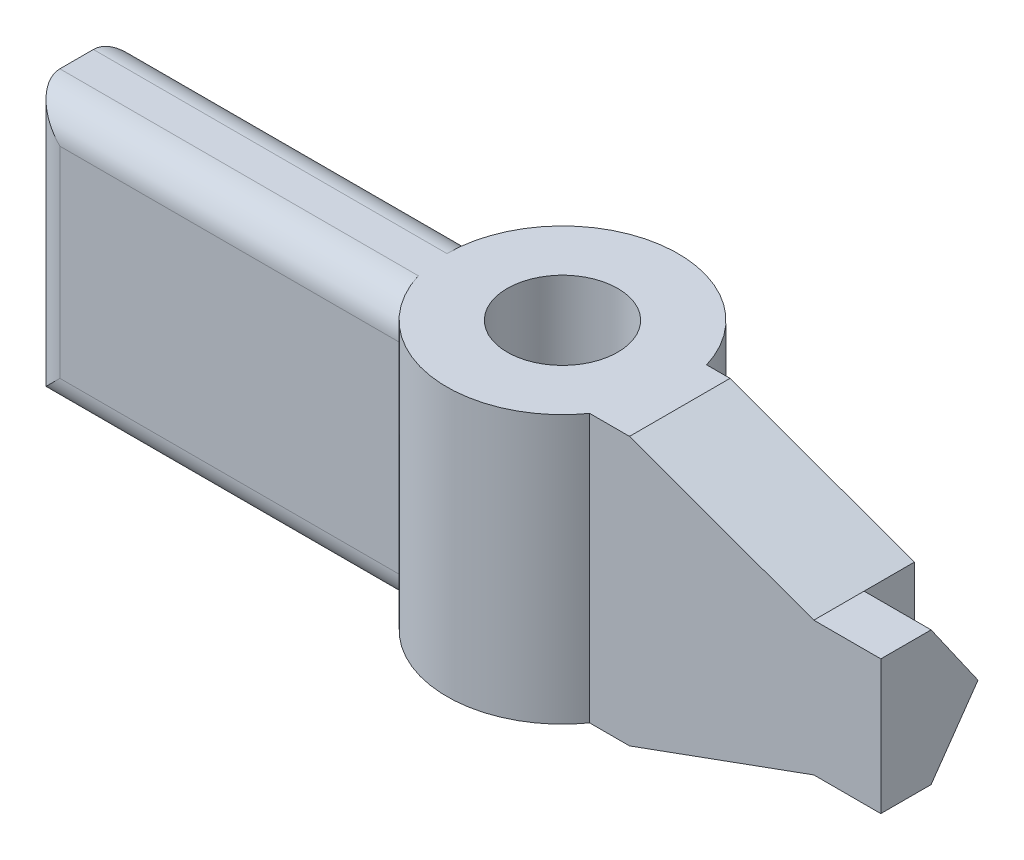
ISO-10303-21;
HEADER;
FILE_DESCRIPTION(('STEP AP214'),'2;1');
FILE_NAME('part.step','',(''),(''),'','','');
FILE_SCHEMA(('AUTOMOTIVE_DESIGN { 1 0 10303 214 1 1 1 1 }'));
ENDSEC;
DATA;
#1=APPLICATION_CONTEXT('core data for automotive mechanical design processes');
#2=APPLICATION_PROTOCOL_DEFINITION('international standard','automotive_design',2000,#1);
#3=PRODUCT_CONTEXT('',#1,'mechanical');
#4=PRODUCT('Part','Part','',(#3));
#5=PRODUCT_RELATED_PRODUCT_CATEGORY('part','',(#4));
#6=PRODUCT_DEFINITION_FORMATION('','',#4);
#7=PRODUCT_DEFINITION_CONTEXT('part definition',#1,'design');
#8=PRODUCT_DEFINITION('design','',#6,#7);
#9=PRODUCT_DEFINITION_SHAPE('','',#8);
#10=(LENGTH_UNIT() NAMED_UNIT(*) SI_UNIT(.MILLI.,.METRE.));
#11=(NAMED_UNIT(*) PLANE_ANGLE_UNIT() SI_UNIT($,.RADIAN.));
#12=(NAMED_UNIT(*) SI_UNIT($,.STERADIAN.) SOLID_ANGLE_UNIT());
#13=UNCERTAINTY_MEASURE_WITH_UNIT(LENGTH_MEASURE(1.E-05),#10,'distance_accuracy_value','');
#14=(GEOMETRIC_REPRESENTATION_CONTEXT(3) GLOBAL_UNCERTAINTY_ASSIGNED_CONTEXT((#13)) GLOBAL_UNIT_ASSIGNED_CONTEXT((#10,
#11,#12)) REPRESENTATION_CONTEXT('',''));
#15=CARTESIAN_POINT('',(0.,0.,0.));
#16=DIRECTION('',(0.,0.,1.));
#17=DIRECTION('',(1.,0.,0.));
#18=AXIS2_PLACEMENT_3D('',#15,#16,#17);
#19=CARTESIAN_POINT('',(4.55189337472552,-29.6222556002751,2.5));
#20=DIRECTION('',(0.,0.,1.));
#21=DIRECTION('',(1.,0.,0.));
#22=AXIS2_PLACEMENT_3D('',#19,#20,#21);
#23=PLANE('',#22);
#24=DIRECTION('',(0.,1.,0.));
#25=VECTOR('',#24,1.);
#26=CARTESIAN_POINT('',(10.7500000214943,-2.,2.5));
#27=LINE('',#26,#25);
#28=CARTESIAN_POINT('',(10.7500000214943,-1.99999921370737,2.5));
#29=VERTEX_POINT('',#28);
#30=CARTESIAN_POINT('',(10.7500000214943,2.,2.5));
#31=VERTEX_POINT('',#30);
#32=EDGE_CURVE('E163',#29,#31,#27,.T.);
#33=ORIENTED_EDGE('',*,*,#32,.F.);
#34=DIRECTION('',(0.939793402771048,0.341743120059518,0.));
#35=VECTOR('',#34,1.);
#36=CARTESIAN_POINT('',(5.2499999785057,-3.99999960685369,2.5));
#37=LINE('',#36,#35);
#38=CARTESIAN_POINT('',(5.2499999785057,-3.99999960685369,2.5));
#39=VERTEX_POINT('',#38);
#40=EDGE_CURVE('E193',#39,#29,#37,.T.);
#41=ORIENTED_EDGE('',*,*,#40,.F.);
#42=DIRECTION('',(-1.,0.,0.));
#43=VECTOR('',#42,1.);
#44=CARTESIAN_POINT('',(4.55189337472551,-3.99999960685369,2.5));
#45=LINE('',#44,#43);
#46=CARTESIAN_POINT('',(4.55189337472552,-3.99999960685369,2.5));
#47=VERTEX_POINT('',#46);
#48=EDGE_CURVE('E194',#39,#47,#45,.T.);
#49=ORIENTED_EDGE('',*,*,#48,.T.);
#50=DIRECTION('',(0.,1.,0.));
#51=VECTOR('',#50,1.);
#52=CARTESIAN_POINT('',(4.55189337472552,-29.6222556002751,2.5));
#53=LINE('',#52,#51);
#54=CARTESIAN_POINT('',(4.55189337472552,4.00000039314631,2.5));
#55=VERTEX_POINT('',#54);
#56=EDGE_CURVE('E503',#47,#55,#53,.T.);
#57=ORIENTED_EDGE('',*,*,#56,.T.);
#58=DIRECTION('',(1.,0.,0.));
#59=VECTOR('',#58,1.);
#60=CARTESIAN_POINT('',(4.55189337472552,4.00000039314631,2.5));
#61=LINE('',#60,#59);
#62=CARTESIAN_POINT('',(5.2499999785057,4.00000039314631,2.5));
#63=VERTEX_POINT('',#62);
#64=EDGE_CURVE('E192',#55,#63,#61,.T.);
#65=ORIENTED_EDGE('',*,*,#64,.T.);
#66=DIRECTION('',(-0.939793402771049,0.341743120059517,0.));
#67=VECTOR('',#66,1.);
#68=CARTESIAN_POINT('',(5.2499999785057,4.00000039314631,2.5));
#69=LINE('',#68,#67);
#70=EDGE_CURVE('E183',#31,#63,#69,.T.);
#71=ORIENTED_EDGE('',*,*,#70,.F.);
#72=EDGE_LOOP('',(#33,#41,#49,#57,#65,#71));
#73=FACE_BOUND('',#72,.T.);
#74=ADVANCED_FACE('F33',(#73),#23,.F.);
#75=CARTESIAN_POINT('',(-12.7500000214943,-3.99999960685369,7.));
#76=DIRECTION('',(1.,0.,0.));
#77=DIRECTION('',(0.,0.,-1.));
#78=AXIS2_PLACEMENT_3D('',#75,#76,#77);
#79=PLANE('',#78);
#80=DIRECTION('',(0.,0.,-1.));
#81=VECTOR('',#80,1.);
#82=CARTESIAN_POINT('',(-12.7500000214943,-3.99999960685369,7.));
#83=LINE('',#82,#81);
#84=CARTESIAN_POINT('',(-12.7500000214943,-3.99999960685369,4.5));
#85=VERTEX_POINT('',#84);
#86=CARTESIAN_POINT('',(-12.7500000214943,-3.99999960685369,3.5));
#87=VERTEX_POINT('',#86);
#88=EDGE_CURVE('E215',#85,#87,#83,.T.);
#89=ORIENTED_EDGE('',*,*,#88,.F.);
#90=DIRECTION('',(0.,1.,0.));
#91=VECTOR('',#90,1.);
#92=CARTESIAN_POINT('',(-12.7500000214943,-3.99999960685369,4.5));
#93=LINE('',#92,#91);
#94=CARTESIAN_POINT('',(-12.7500000214943,4.00000039314631,4.5));
#95=VERTEX_POINT('',#94);
#96=EDGE_CURVE('E235',#85,#95,#93,.T.);
#97=ORIENTED_EDGE('',*,*,#96,.T.);
#98=DIRECTION('',(0.,0.,-1.));
#99=VECTOR('',#98,1.);
#100=CARTESIAN_POINT('',(-12.7500000214943,4.00000039314631,7.));
#101=LINE('',#100,#99);
#102=CARTESIAN_POINT('',(-12.7500000214943,4.00000039314631,3.5));
#103=VERTEX_POINT('',#102);
#104=EDGE_CURVE('E218',#95,#103,#101,.T.);
#105=ORIENTED_EDGE('',*,*,#104,.T.);
#106=DIRECTION('',(0.,1.,0.));
#107=VECTOR('',#106,1.);
#108=CARTESIAN_POINT('',(-12.7500000214943,-3.99999960685369,3.5));
#109=LINE('',#108,#107);
#110=EDGE_CURVE('E233',#103,#87,#109,.F.);
#111=ORIENTED_EDGE('',*,*,#110,.T.);
#112=EDGE_LOOP('',(#89,#97,#105,#111));
#113=FACE_BOUND('',#112,.T.);
#114=ADVANCED_FACE('F271',(#113),#79,.F.);
#115=CARTESIAN_POINT('',(5.2499999785057,-3.99999960685369,7.));
#116=DIRECTION('',(0.,1.,0.));
#117=DIRECTION('',(-1.,0.,0.));
#118=AXIS2_PLACEMENT_3D('',#115,#116,#117);
#119=PLANE('',#118);
#120=CARTESIAN_POINT('',(1.24999997850571,-3.99999960685369,3.5));
#121=DIRECTION('',(0.,1.,0.));
#122=DIRECTION('',(-1.,0.,0.));
#123=AXIS2_PLACEMENT_3D('',#120,#121,#122);
#124=CIRCLE('',#123,1.65);
#125=CARTESIAN_POINT('',(-0.400000021494294,-3.99999960685369,3.5));
#126=VERTEX_POINT('',#125);
#127=EDGE_CURVE('E468',#126,#126,#124,.F.);
#128=ORIENTED_EDGE('',*,*,#127,.F.);
#129=EDGE_LOOP('',(#128));
#130=FACE_BOUND('',#129,.T.);
#131=CARTESIAN_POINT('',(1.24999997850571,-3.99999960685369,3.5));
#132=DIRECTION('',(0.,1.,0.));
#133=DIRECTION('',(-1.,0.,0.));
#134=AXIS2_PLACEMENT_3D('',#131,#132,#133);
#135=CIRCLE('',#134,3.45);
#136=CARTESIAN_POINT('',(-2.0518934177141,-3.99999960685369,4.5));
#137=VERTEX_POINT('',#136);
#138=CARTESIAN_POINT('',(4.06113853787983,-3.99999960685369,5.50000000000001));
#139=VERTEX_POINT('',#138);
#140=EDGE_CURVE('E474',#137,#139,#135,.T.);
#141=ORIENTED_EDGE('',*,*,#140,.F.);
#142=DIRECTION('',(1.,0.,0.));
#143=VECTOR('',#142,1.);
#144=CARTESIAN_POINT('',(5.2499999785057,-3.99999960685369,4.5));
#145=LINE('',#144,#143);
#146=EDGE_CURVE('E240',#137,#85,#145,.F.);
#147=ORIENTED_EDGE('',*,*,#146,.T.);
#148=ORIENTED_EDGE('',*,*,#88,.T.);
#149=DIRECTION('',(-1.,0.,0.));
#150=VECTOR('',#149,1.);
#151=CARTESIAN_POINT('',(5.2499999785057,-3.99999960685369,3.5));
#152=LINE('',#151,#150);
#153=CARTESIAN_POINT('',(-2.20000002149429,-3.99999960685369,3.5));
#154=VERTEX_POINT('',#153);
#155=EDGE_CURVE('E237',#87,#154,#152,.F.);
#156=ORIENTED_EDGE('',*,*,#155,.T.);
#157=CARTESIAN_POINT('',(1.24999997850571,-3.99999960685369,3.5));
#158=DIRECTION('',(0.,1.,0.));
#159=DIRECTION('',(-1.,0.,0.));
#160=AXIS2_PLACEMENT_3D('',#157,#158,#159);
#161=CIRCLE('',#160,3.45);
#162=EDGE_CURVE('E198',#47,#154,#161,.T.);
#163=ORIENTED_EDGE('',*,*,#162,.F.);
#164=ORIENTED_EDGE('',*,*,#48,.F.);
#165=DIRECTION('',(0.,0.,-1.));
#166=VECTOR('',#165,1.);
#167=CARTESIAN_POINT('',(5.2499999785057,-3.99999960685369,7.));
#168=LINE('',#167,#166);
#169=CARTESIAN_POINT('',(5.2499999785057,-3.99999960685369,5.50000000000001));
#170=VERTEX_POINT('',#169);
#171=EDGE_CURVE('E213',#170,#39,#168,.T.);
#172=ORIENTED_EDGE('',*,*,#171,.F.);
#173=DIRECTION('',(1.,0.,0.));
#174=VECTOR('',#173,1.);
#175=CARTESIAN_POINT('',(4.06113853787982,-3.99999960685369,5.50000000000001));
#176=LINE('',#175,#174);
#177=EDGE_CURVE('E472',#139,#170,#176,.T.);
#178=ORIENTED_EDGE('',*,*,#177,.F.);
#179=EDGE_LOOP('',(#141,#147,#148,#156,#163,#164,#172,#178));
#180=FACE_BOUND('',#179,.T.);
#181=ADVANCED_FACE('F320',(#130,#180),#119,.F.);
#182=CARTESIAN_POINT('',(5.2499999785057,-3.99999960685369,7.));
#183=DIRECTION('',(-0.341743120059518,0.939793402771048,0.));
#184=DIRECTION('',(-0.939793402771048,-0.341743120059518,0.));
#185=AXIS2_PLACEMENT_3D('',#182,#183,#184);
#186=PLANE('',#185);
#187=DIRECTION('',(0.,0.,-1.));
#188=VECTOR('',#187,1.);
#189=CARTESIAN_POINT('',(10.7500000214943,-1.99999921370737,7.));
#190=LINE('',#189,#188);
#191=CARTESIAN_POINT('',(10.7500000214943,-1.99999921370737,5.50000000000001));
#192=VERTEX_POINT('',#191);
#193=CARTESIAN_POINT('',(10.7500000214943,-2.,4.));
#194=VERTEX_POINT('',#193);
#195=EDGE_CURVE('E210',#192,#194,#190,.T.);
#196=ORIENTED_EDGE('',*,*,#195,.F.);
#197=DIRECTION('',(-0.939793402771048,-0.341743120059518,0.));
#198=VECTOR('',#197,1.);
#199=CARTESIAN_POINT('',(5.2499999785057,-3.99999960685369,5.50000000000001));
#200=LINE('',#199,#198);
#201=EDGE_CURVE('E495',#192,#170,#200,.T.);
#202=ORIENTED_EDGE('',*,*,#201,.T.);
#203=ORIENTED_EDGE('',*,*,#171,.T.);
#204=ORIENTED_EDGE('',*,*,#40,.T.);
#205=DIRECTION('',(0.,0.,-1.));
#206=VECTOR('',#205,1.);
#207=CARTESIAN_POINT('',(10.7500000214943,-2.,4.));
#208=LINE('',#207,#206);
#209=EDGE_CURVE('E171',#194,#29,#208,.T.);
#210=ORIENTED_EDGE('',*,*,#209,.F.);
#211=EDGE_LOOP('',(#196,#202,#203,#204,#210));
#212=FACE_BOUND('',#211,.T.);
#213=ADVANCED_FACE('F317',(#212),#186,.F.);
#214=CARTESIAN_POINT('',(12.7500000214943,-1.99999921370737,7.));
#215=DIRECTION('',(0.,1.,0.));
#216=DIRECTION('',(-1.,0.,0.));
#217=AXIS2_PLACEMENT_3D('',#214,#215,#216);
#218=PLANE('',#217);
#219=ORIENTED_EDGE('',*,*,#195,.T.);
#220=DIRECTION('',(1.,0.,0.));
#221=VECTOR('',#220,1.);
#222=CARTESIAN_POINT('',(10.7500000214943,-2.,4.));
#223=LINE('',#222,#221);
#224=CARTESIAN_POINT('',(12.7500000214943,-2.,4.));
#225=VERTEX_POINT('',#224);
#226=EDGE_CURVE('E458',#194,#225,#223,.T.);
#227=ORIENTED_EDGE('',*,*,#226,.T.);
#228=DIRECTION('',(0.,0.,-1.));
#229=VECTOR('',#228,1.);
#230=CARTESIAN_POINT('',(12.7500000214943,-1.99999921370737,7.));
#231=LINE('',#230,#229);
#232=CARTESIAN_POINT('',(12.7500000214943,-1.99999921370737,5.50000000000001));
#233=VERTEX_POINT('',#232);
#234=EDGE_CURVE('E207',#233,#225,#231,.T.);
#235=ORIENTED_EDGE('',*,*,#234,.F.);
#236=DIRECTION('',(-1.,0.,0.));
#237=VECTOR('',#236,1.);
#238=CARTESIAN_POINT('',(12.7500000214943,-1.99999921370737,5.50000000000001));
#239=LINE('',#238,#237);
#240=EDGE_CURVE('E492',#233,#192,#239,.T.);
#241=ORIENTED_EDGE('',*,*,#240,.T.);
#242=EDGE_LOOP('',(#219,#227,#235,#241));
#243=FACE_BOUND('',#242,.T.);
#244=ADVANCED_FACE('F313',(#243),#218,.F.);
#245=CARTESIAN_POINT('',(12.7500000214943,2.,7.));
#246=DIRECTION('',(-1.,0.,0.));
#247=DIRECTION('',(0.,0.,1.));
#248=AXIS2_PLACEMENT_3D('',#245,#246,#247);
#249=PLANE('',#248);
#250=ORIENTED_EDGE('',*,*,#234,.T.);
#251=DIRECTION('',(0.,-0.81923192051904,0.573462344363329));
#252=VECTOR('',#251,1.);
#253=CARTESIAN_POINT('',(12.7500000214943,-2.,4.));
#254=LINE('',#253,#252);
#255=CARTESIAN_POINT('',(12.7500000214943,0.,2.6));
#256=VERTEX_POINT('',#255);
#257=EDGE_CURVE('E176',#256,#225,#254,.T.);
#258=ORIENTED_EDGE('',*,*,#257,.F.);
#259=DIRECTION('',(0.,-0.81923192051904,-0.573462344363329));
#260=VECTOR('',#259,1.);
#261=CARTESIAN_POINT('',(12.7500000214943,2.,4.));
#262=LINE('',#261,#260);
#263=CARTESIAN_POINT('',(12.7500000214943,2.,4.));
#264=VERTEX_POINT('',#263);
#265=EDGE_CURVE('E445',#264,#256,#262,.T.);
#266=ORIENTED_EDGE('',*,*,#265,.F.);
#267=DIRECTION('',(0.,0.,-1.));
#268=VECTOR('',#267,1.);
#269=CARTESIAN_POINT('',(12.7500000214943,2.,7.));
#270=LINE('',#269,#268);
#271=CARTESIAN_POINT('',(12.7500000214943,2.,5.50000000000001));
#272=VERTEX_POINT('',#271);
#273=EDGE_CURVE('E204',#272,#264,#270,.T.);
#274=ORIENTED_EDGE('',*,*,#273,.F.);
#275=DIRECTION('',(0.,1.,0.));
#276=VECTOR('',#275,1.);
#277=CARTESIAN_POINT('',(12.7500000214943,-29.6222556002751,5.50000000000001));
#278=LINE('',#277,#276);
#279=EDGE_CURVE('E484',#233,#272,#278,.T.);
#280=ORIENTED_EDGE('',*,*,#279,.F.);
#281=EDGE_LOOP('',(#250,#258,#266,#274,#280));
#282=FACE_BOUND('',#281,.T.);
#283=ADVANCED_FACE('F309',(#282),#249,.F.);
#284=CARTESIAN_POINT('',(10.7500000214943,2.,7.));
#285=DIRECTION('',(0.,-1.,0.));
#286=DIRECTION('',(0.,0.,-1.));
#287=AXIS2_PLACEMENT_3D('',#284,#285,#286);
#288=PLANE('',#287);
#289=ORIENTED_EDGE('',*,*,#273,.T.);
#290=DIRECTION('',(1.,0.,0.));
#291=VECTOR('',#290,1.);
#292=CARTESIAN_POINT('',(10.7500000214943,2.,4.));
#293=LINE('',#292,#291);
#294=CARTESIAN_POINT('',(10.7500000214943,2.,4.));
#295=VERTEX_POINT('',#294);
#296=EDGE_CURVE('E464',#295,#264,#293,.T.);
#297=ORIENTED_EDGE('',*,*,#296,.F.);
#298=DIRECTION('',(0.,0.,-1.));
#299=VECTOR('',#298,1.);
#300=CARTESIAN_POINT('',(10.7500000214943,2.,7.));
#301=LINE('',#300,#299);
#302=CARTESIAN_POINT('',(10.7500000214943,2.,5.50000000000001));
#303=VERTEX_POINT('',#302);
#304=EDGE_CURVE('E186',#303,#295,#301,.T.);
#305=ORIENTED_EDGE('',*,*,#304,.F.);
#306=DIRECTION('',(1.,0.,0.));
#307=VECTOR('',#306,1.);
#308=CARTESIAN_POINT('',(10.7500000214943,2.,5.50000000000001));
#309=LINE('',#308,#307);
#310=EDGE_CURVE('E489',#303,#272,#309,.T.);
#311=ORIENTED_EDGE('',*,*,#310,.T.);
#312=EDGE_LOOP('',(#289,#297,#305,#311));
#313=FACE_BOUND('',#312,.T.);
#314=ADVANCED_FACE('F306',(#313),#288,.F.);
#315=CARTESIAN_POINT('',(5.2499999785057,4.00000039314631,7.));
#316=DIRECTION('',(-0.341743120059517,-0.939793402771049,0.));
#317=DIRECTION('',(0.939793402771049,-0.341743120059517,0.));
#318=AXIS2_PLACEMENT_3D('',#315,#316,#317);
#319=PLANE('',#318);
#320=DIRECTION('',(0.,0.,-1.));
#321=VECTOR('',#320,1.);
#322=CARTESIAN_POINT('',(5.2499999785057,4.00000039314631,7.));
#323=LINE('',#322,#321);
#324=CARTESIAN_POINT('',(5.2499999785057,4.00000039314631,5.50000000000001));
#325=VERTEX_POINT('',#324);
#326=EDGE_CURVE('E196',#325,#63,#323,.T.);
#327=ORIENTED_EDGE('',*,*,#326,.F.);
#328=DIRECTION('',(0.939793402771049,-0.341743120059517,0.));
#329=VECTOR('',#328,1.);
#330=CARTESIAN_POINT('',(5.2499999785057,4.00000039314631,5.50000000000001));
#331=LINE('',#330,#329);
#332=EDGE_CURVE('E477',#325,#303,#331,.T.);
#333=ORIENTED_EDGE('',*,*,#332,.T.);
#334=ORIENTED_EDGE('',*,*,#304,.T.);
#335=DIRECTION('',(0.,0.,1.));
#336=VECTOR('',#335,1.);
#337=CARTESIAN_POINT('',(10.7500000214943,2.,2.5));
#338=LINE('',#337,#336);
#339=EDGE_CURVE('E167',#31,#295,#338,.T.);
#340=ORIENTED_EDGE('',*,*,#339,.F.);
#341=ORIENTED_EDGE('',*,*,#70,.T.);
#342=EDGE_LOOP('',(#327,#333,#334,#340,#341));
#343=FACE_BOUND('',#342,.T.);
#344=ADVANCED_FACE('F182',(#343),#319,.F.);
#345=CARTESIAN_POINT('',(-2.7500000214943,4.00000039314631,7.));
#346=DIRECTION('',(0.,-1.,0.));
#347=DIRECTION('',(0.,0.,-1.));
#348=AXIS2_PLACEMENT_3D('',#345,#346,#347);
#349=PLANE('',#348);
#350=CARTESIAN_POINT('',(1.24999997850571,4.00000039314631,3.5));
#351=DIRECTION('',(0.,1.,0.));
#352=DIRECTION('',(0.,0.,-1.));
#353=AXIS2_PLACEMENT_3D('',#350,#351,#352);
#354=CIRCLE('',#353,1.65);
#355=CARTESIAN_POINT('',(1.24999997850571,4.00000039314631,1.85));
#356=VERTEX_POINT('',#355);
#357=EDGE_CURVE('E461',#356,#356,#354,.T.);
#358=ORIENTED_EDGE('',*,*,#357,.F.);
#359=EDGE_LOOP('',(#358));
#360=FACE_BOUND('',#359,.T.);
#361=ORIENTED_EDGE('',*,*,#104,.F.);
#362=DIRECTION('',(-1.,0.,0.));
#363=VECTOR('',#362,1.);
#364=CARTESIAN_POINT('',(-2.7500000214943,4.00000039314631,4.5));
#365=LINE('',#364,#363);
#366=CARTESIAN_POINT('',(-2.0518934177141,4.00000039314631,4.5));
#367=VERTEX_POINT('',#366);
#368=EDGE_CURVE('E230',#95,#367,#365,.F.);
#369=ORIENTED_EDGE('',*,*,#368,.T.);
#370=CARTESIAN_POINT('',(1.24999997850571,4.00000039314631,3.5));
#371=DIRECTION('',(0.,-1.,0.));
#372=DIRECTION('',(0.,0.,1.));
#373=AXIS2_PLACEMENT_3D('',#370,#371,#372);
#374=CIRCLE('',#373,3.45);
#375=CARTESIAN_POINT('',(4.06113853787983,4.00000039314631,5.50000000000001));
#376=VERTEX_POINT('',#375);
#377=EDGE_CURVE('E471',#376,#367,#374,.T.);
#378=ORIENTED_EDGE('',*,*,#377,.F.);
#379=DIRECTION('',(-1.,0.,0.));
#380=VECTOR('',#379,1.);
#381=CARTESIAN_POINT('',(4.06113853787983,4.00000039314631,5.50000000000001));
#382=LINE('',#381,#380);
#383=EDGE_CURVE('E479',#325,#376,#382,.T.);
#384=ORIENTED_EDGE('',*,*,#383,.F.);
#385=ORIENTED_EDGE('',*,*,#326,.T.);
#386=ORIENTED_EDGE('',*,*,#64,.F.);
#387=CARTESIAN_POINT('',(1.24999997850571,4.00000039314631,3.5));
#388=DIRECTION('',(0.,-1.,0.));
#389=DIRECTION('',(0.,0.,1.));
#390=AXIS2_PLACEMENT_3D('',#387,#388,#389);
#391=CIRCLE('',#390,3.45);
#392=CARTESIAN_POINT('',(-2.20000002149429,4.00000039314631,3.5));
#393=VERTEX_POINT('',#392);
#394=EDGE_CURVE('E498',#393,#55,#391,.T.);
#395=ORIENTED_EDGE('',*,*,#394,.F.);
#396=DIRECTION('',(1.,0.,0.));
#397=VECTOR('',#396,1.);
#398=CARTESIAN_POINT('',(-2.7500000214943,4.00000039314631,3.5));
#399=LINE('',#398,#397);
#400=EDGE_CURVE('E228',#393,#103,#399,.F.);
#401=ORIENTED_EDGE('',*,*,#400,.T.);
#402=EDGE_LOOP('',(#361,#369,#378,#384,#385,#386,#395,#401));
#403=FACE_BOUND('',#402,.T.);
#404=ADVANCED_FACE('F298',(#360,#403),#349,.F.);
#405=CARTESIAN_POINT('',(1.24999997850571,-29.6222556002751,3.5));
#406=DIRECTION('',(0.,1.,0.));
#407=DIRECTION('',(0.,0.,1.));
#408=AXIS2_PLACEMENT_3D('',#405,#406,#407);
#409=CYLINDRICAL_SURFACE('',#408,3.45);
#410=ORIENTED_EDGE('',*,*,#162,.T.);
#411=CARTESIAN_POINT('',(-2.20000002149429,-3.99999960685369,3.5));
#412=CARTESIAN_POINT('',(-2.2000018186365,-4.00000005976207,3.47247568580753));
#413=CARTESIAN_POINT('',(-2.19967023770615,-3.99886249286738,3.4449650885411));
#414=CARTESIAN_POINT('',(-2.19835948173658,-3.99432848692219,3.39015136632369));
#415=CARTESIAN_POINT('',(-2.19738042933208,-3.99093247563304,3.3628482030739));
#416=CARTESIAN_POINT('',(-2.19350893526232,-3.97741096564679,3.28167883124371));
#417=CARTESIAN_POINT('',(-2.18968190929803,-3.96395172890271,3.22837320570246));
#418=CARTESIAN_POINT('',(-2.17994221924015,-3.92859473069727,3.12489275289327));
#419=CARTESIAN_POINT('',(-2.17402991860865,-3.90669843974779,3.0747173818164));
#420=CARTESIAN_POINT('',(-2.16073677324155,-3.85512798710265,2.97872840882544));
#421=CARTESIAN_POINT('',(-2.1533553584972,-3.8254508050385,2.93291651014914));
#422=CARTESIAN_POINT('',(-2.13769423876483,-3.75832697391133,2.84575339156167));
#423=CARTESIAN_POINT('',(-2.12939717162977,-3.72071031105168,2.8045362887991));
#424=CARTESIAN_POINT('',(-2.11294458914971,-3.63913147877234,2.72889350549633));
#425=CARTESIAN_POINT('',(-2.10478910982013,-3.59516772059835,2.69446953047924));
#426=CARTESIAN_POINT('',(-2.08935888528671,-3.50101469073373,2.63269342444564));
#427=CARTESIAN_POINT('',(-2.08210632152021,-3.45071375143932,2.60550560588157));
#428=CARTESIAN_POINT('',(-2.06956993268079,-3.34602659672756,2.56004527390904));
#429=CARTESIAN_POINT('',(-2.06428431604705,-3.29164415341256,2.54176464281931));
#430=CARTESIAN_POINT('',(-2.05757091852246,-3.19749274026799,2.51889249057409));
#431=CARTESIAN_POINT('',(-2.05545712311073,-3.15835751731527,2.51182205581527));
#432=CARTESIAN_POINT('',(-2.05261158528801,-3.07948927821282,2.50237117494375));
#433=CARTESIAN_POINT('',(-2.05187939868124,-3.03975645833672,2.49998922144464));
#434=CARTESIAN_POINT('',(-2.0518934177141,-2.99999960685369,2.5));
#435=B_SPLINE_CURVE_WITH_KNOTS('',3,(#411,#412,#413,#414,#415,#416,#417,#418,#419,#420,#421,
#422,#423,#424,#425,#426,#427,#428,#429,#430,#431,#432,#433,#434),.UNSPECIFIED.,.F.,.F.,(4,2,2,
2,2,2,2,2,2,2,2,4),(0.,0.0825205058444888,0.165025386317305,0.329503611712889,0.493953182810833,
0.658466684322334,0.826945128512405,0.995465818237975,1.16753775995018,1.33945258696452,
1.4586391129712,1.57778731323737),.UNSPECIFIED.);
#436=CARTESIAN_POINT('',(-2.0518934177141,-2.99999960685369,2.5));
#437=VERTEX_POINT('',#436);
#438=EDGE_CURVE('E43',#154,#437,#435,.T.);
#439=ORIENTED_EDGE('',*,*,#438,.T.);
#440=DIRECTION('',(0.,1.,0.));
#441=VECTOR('',#440,1.);
#442=CARTESIAN_POINT('',(-2.0518934177141,-29.6222556002751,2.5));
#443=LINE('',#442,#441);
#444=CARTESIAN_POINT('',(-2.0518934177141,3.00000039314631,2.5));
#445=VERTEX_POINT('',#444);
#446=EDGE_CURVE('E500',#437,#445,#443,.T.);
#447=ORIENTED_EDGE('',*,*,#446,.T.);
#448=CARTESIAN_POINT('',(-2.0518934177141,3.00000039314631,2.5));
#449=CARTESIAN_POINT('',(-2.05189117613897,3.02750011168371,2.49999948141562));
#450=CARTESIAN_POINT('',(-2.05223739957496,3.05498602947934,2.50113507810029));
#451=CARTESIAN_POINT('',(-2.05360379854214,3.10974898039133,2.50566080906622));
#452=CARTESIAN_POINT('',(-2.05462383090197,3.13702605663723,2.50905046440464));
#453=CARTESIAN_POINT('',(-2.05865138121763,3.218107875543,2.52254444568107));
#454=CARTESIAN_POINT('',(-2.0626266594985,3.27135018661563,2.53597406810182));
#455=CARTESIAN_POINT('',(-2.07268650220836,3.37470027111696,2.57124495691434));
#456=CARTESIAN_POINT('',(-2.07877048435104,3.42480890535831,2.59308390138502));
#457=CARTESIAN_POINT('',(-2.09235843768682,3.52068673692262,2.64452015072984));
#458=CARTESIAN_POINT('',(-2.09986305497996,3.56645394550765,2.67412098805518));
#459=CARTESIAN_POINT('',(-2.11569228680892,3.65366340237284,2.74116525721702));
#460=CARTESIAN_POINT('',(-2.1240333768914,3.69495864735841,2.77879596455483));
#461=CARTESIAN_POINT('',(-2.14045549907145,3.77075328629395,2.86043556414651));
#462=CARTESIAN_POINT('',(-2.14853648059072,3.80525136512987,2.90444568783491));
#463=CARTESIAN_POINT('',(-2.16371659044553,3.86711055386505,2.9986452804875));
#464=CARTESIAN_POINT('',(-2.17079352891558,3.89431956506745,3.04893841178835));
#465=CARTESIAN_POINT('',(-2.18296992679213,3.93982213711336,3.15361120730929));
#466=CARTESIAN_POINT('',(-2.18807105717243,3.95812323490491,3.2079873717651));
#467=CARTESIAN_POINT('',(-2.19454232306193,3.98104777305237,3.30219378827167));
#468=CARTESIAN_POINT('',(-2.1965761221573,3.98814142530742,3.34139486723624));
#469=CARTESIAN_POINT('',(-2.19931062280045,3.99762204012651,3.42038972964227));
#470=CARTESIAN_POINT('',(-2.20001189734747,4.00001102576162,3.46018325090508));
#471=CARTESIAN_POINT('',(-2.20000002149429,4.00000039314631,3.5));
#472=B_SPLINE_CURVE_WITH_KNOTS('',3,(#448,#449,#450,#451,#452,#453,#454,#455,#456,#457,#458,
#459,#460,#461,#462,#463,#464,#465,#466,#467,#468,#469,#470,#471),.UNSPECIFIED.,.F.,.F.,(4,2,2,
2,2,2,2,2,2,2,2,4),(0.,0.0824464864568015,0.164875460262209,0.32917986647785,0.493438938644251,
0.657772895541085,0.826467831037533,0.995195373607087,1.16720932169958,1.3390774754249,
1.4584582408229,1.57778765963778),.UNSPECIFIED.);
#473=EDGE_CURVE('E11',#445,#393,#472,.T.);
#474=ORIENTED_EDGE('',*,*,#473,.T.);
#475=ORIENTED_EDGE('',*,*,#394,.T.);
#476=ORIENTED_EDGE('',*,*,#56,.F.);
#477=EDGE_LOOP('',(#410,#439,#447,#474,#475,#476));
#478=FACE_BOUND('',#477,.T.);
#479=ADVANCED_FACE('F292',(#478),#409,.T.);
#480=CARTESIAN_POINT('',(-12.7500000214943,-29.6222556002751,2.5));
#481=DIRECTION('',(0.,0.,1.));
#482=DIRECTION('',(1.,0.,0.));
#483=AXIS2_PLACEMENT_3D('',#480,#481,#482);
#484=PLANE('',#483);
#485=ORIENTED_EDGE('',*,*,#446,.F.);
#486=DIRECTION('',(-1.,0.,0.));
#487=VECTOR('',#486,1.);
#488=CARTESIAN_POINT('',(-12.7500000214943,-2.99999960685369,2.5));
#489=LINE('',#488,#487);
#490=CARTESIAN_POINT('',(-11.7500000214943,-2.99999960685369,2.5));
#491=VERTEX_POINT('',#490);
#492=EDGE_CURVE('E245',#437,#491,#489,.T.);
#493=ORIENTED_EDGE('',*,*,#492,.T.);
#494=DIRECTION('',(0.,1.,0.));
#495=VECTOR('',#494,1.);
#496=CARTESIAN_POINT('',(-11.7500000214943,-29.6222556002751,2.5));
#497=LINE('',#496,#495);
#498=CARTESIAN_POINT('',(-11.7500000214943,3.00000039314631,2.5));
#499=VERTEX_POINT('',#498);
#500=EDGE_CURVE('E58',#491,#499,#497,.T.);
#501=ORIENTED_EDGE('',*,*,#500,.T.);
#502=DIRECTION('',(1.,0.,0.));
#503=VECTOR('',#502,1.);
#504=CARTESIAN_POINT('',(-12.7500000214943,3.00000039314631,2.5));
#505=LINE('',#504,#503);
#506=EDGE_CURVE('E242',#499,#445,#505,.T.);
#507=ORIENTED_EDGE('',*,*,#506,.T.);
#508=EDGE_LOOP('',(#485,#493,#501,#507));
#509=FACE_BOUND('',#508,.T.);
#510=ADVANCED_FACE('F297',(#509),#484,.F.);
#511=CARTESIAN_POINT('',(4.06113853787983,-29.6222556002751,5.50000000000001));
#512=DIRECTION('',(0.,0.,-1.));
#513=DIRECTION('',(-1.,0.,0.));
#514=AXIS2_PLACEMENT_3D('',#511,#512,#513);
#515=PLANE('',#514);
#516=ORIENTED_EDGE('',*,*,#240,.F.);
#517=ORIENTED_EDGE('',*,*,#279,.T.);
#518=ORIENTED_EDGE('',*,*,#310,.F.);
#519=ORIENTED_EDGE('',*,*,#332,.F.);
#520=ORIENTED_EDGE('',*,*,#383,.T.);
#521=DIRECTION('',(0.,1.,0.));
#522=VECTOR('',#521,1.);
#523=CARTESIAN_POINT('',(4.06113853787983,-29.6222556002751,5.50000000000001));
#524=LINE('',#523,#522);
#525=EDGE_CURVE('E475',#139,#376,#524,.T.);
#526=ORIENTED_EDGE('',*,*,#525,.F.);
#527=ORIENTED_EDGE('',*,*,#177,.T.);
#528=ORIENTED_EDGE('',*,*,#201,.F.);
#529=EDGE_LOOP('',(#516,#517,#518,#519,#520,#526,#527,#528));
#530=FACE_BOUND('',#529,.T.);
#531=ADVANCED_FACE('F372',(#530),#515,.F.);
#532=CARTESIAN_POINT('',(1.24999997850571,-29.6222556002751,3.5));
#533=DIRECTION('',(0.,1.,0.));
#534=DIRECTION('',(0.,0.,1.));
#535=AXIS2_PLACEMENT_3D('',#532,#533,#534);
#536=CYLINDRICAL_SURFACE('',#535,3.45);
#537=ORIENTED_EDGE('',*,*,#140,.T.);
#538=ORIENTED_EDGE('',*,*,#525,.T.);
#539=ORIENTED_EDGE('',*,*,#377,.T.);
#540=CARTESIAN_POINT('',(-2.0518934177141,4.00000039314631,4.5));
#541=CARTESIAN_POINT('',(-2.04283879670831,4.00000025593652,4.52990583799341));
#542=CARTESIAN_POINT('',(-2.03337869854973,3.99865846757503,4.55966757459111));
#543=CARTESIAN_POINT('',(-2.01373599336723,3.99337259983071,4.61870102987816));
#544=CARTESIAN_POINT('',(-2.00355377422868,3.98942990820786,4.64797300135503));
#545=CARTESIAN_POINT('',(-1.97213055384728,3.97386388453231,4.73455359735196));
#546=CARTESIAN_POINT('',(-1.94993463140476,3.95850114828117,4.79088408677297));
#547=CARTESIAN_POINT('',(-1.90401659879288,3.9186227141636,4.89933974829807));
#548=CARTESIAN_POINT('',(-1.88029732160387,3.89412362124683,4.95147234216309));
#549=CARTESIAN_POINT('',(-1.83234359586282,3.83666669031156,5.05070909293334));
#550=CARTESIAN_POINT('',(-1.8081084161032,3.80369599579577,5.09780545163903));
#551=CARTESIAN_POINT('',(-1.75906198639805,3.72782920227775,5.1884465318785));
#552=CARTESIAN_POINT('',(-1.73429752178058,3.68447200819151,5.2316322074554));
#553=CARTESIAN_POINT('',(-1.68747445131089,3.58973670727332,5.30992355708326));
#554=CARTESIAN_POINT('',(-1.66541287853815,3.53836753848754,5.34503812844365));
#555=CARTESIAN_POINT('',(-1.63051714280942,3.44081005377282,5.39892465307625));
#556=CARTESIAN_POINT('',(-1.616722031436,3.39601102795202,5.41959440481575));
#557=CARTESIAN_POINT('',(-1.59318557457739,3.30296706043091,5.45428680285801));
#558=CARTESIAN_POINT('',(-1.58343440750588,3.25473080499787,5.46832556561137));
#559=CARTESIAN_POINT('',(-1.57126483642985,3.17189684377251,5.48570920592236));
#560=CARTESIAN_POINT('',(-1.56749671116923,3.13790245311392,5.49104130986157));
#561=CARTESIAN_POINT('',(-1.56242048041418,3.06928359648834,5.4981983209679));
#562=CARTESIAN_POINT('',(-1.56111840816814,3.03465779396008,5.50001462690279));
#563=CARTESIAN_POINT('',(-1.56113858086841,3.00000039314631,5.50000000000001));
#564=B_SPLINE_CURVE_WITH_KNOTS('',3,(#540,#541,#542,#543,#544,#545,#546,#547,#548,#549,#550,
#551,#552,#553,#554,#555,#556,#557,#558,#559,#560,#561,#562,#563),.UNSPECIFIED.,.F.,.F.,(4,2,2,
2,2,2,2,2,2,2,2,4),(0.,0.0936707518349631,0.187291564291696,0.37373745513157,0.559846126747802,
0.746238922347534,0.943330888801302,1.1402045344959,1.29328565682641,1.44599278012782,
1.54958435064527,1.65342903428219),.UNSPECIFIED.);
#565=CARTESIAN_POINT('',(-1.56113858086841,3.00000039314631,5.50000000000001));
#566=VERTEX_POINT('',#565);
#567=EDGE_CURVE('E247',#367,#566,#564,.T.);
#568=ORIENTED_EDGE('',*,*,#567,.T.);
#569=DIRECTION('',(0.,1.,0.));
#570=VECTOR('',#569,1.);
#571=CARTESIAN_POINT('',(-1.56113858086841,-29.6222556002751,5.50000000000001));
#572=LINE('',#571,#570);
#573=CARTESIAN_POINT('',(-1.56113858086841,-2.99999960685369,5.50000000000001));
#574=VERTEX_POINT('',#573);
#575=EDGE_CURVE('E481',#574,#566,#572,.T.);
#576=ORIENTED_EDGE('',*,*,#575,.F.);
#577=CARTESIAN_POINT('',(-1.56113858086841,-2.99999960685369,5.50000000000001));
#578=CARTESIAN_POINT('',(-1.5611345150706,-3.02500300819546,5.50000239854365));
#579=CARTESIAN_POINT('',(-1.56180643475591,-3.04999184109344,5.4990615628761));
#580=CARTESIAN_POINT('',(-1.56446001246465,-3.09974404327885,5.49532529288365));
#581=CARTESIAN_POINT('',(-1.56644079247631,-3.12450755243658,5.49253110182483));
#582=CARTESIAN_POINT('',(-1.57424503957477,-3.19784509958582,5.48147031300766));
#583=CARTESIAN_POINT('',(-1.58193175774886,-3.24584911751167,5.47052438511979));
#584=CARTESIAN_POINT('',(-1.60148671303587,-3.33879240485401,5.4421160280017));
#585=CARTESIAN_POINT('',(-1.61334523489067,-3.38373850775145,5.42466873355177));
#586=CARTESIAN_POINT('',(-1.64027912937032,-3.46995199727568,5.3839802614321));
#587=CARTESIAN_POINT('',(-1.65535986048148,-3.51121309169394,5.36072942158277));
#588=CARTESIAN_POINT('',(-1.68925735039141,-3.59309938407131,5.30675714475457));
#589=CARTESIAN_POINT('',(-1.70829127973631,-3.63330720403102,5.27554152028142));
#590=CARTESIAN_POINT('',(-1.74787864341648,-3.70816113954919,5.20785342932075));
#591=CARTESIAN_POINT('',(-1.76843285103775,-3.74280439589499,5.1713782785062));
#592=CARTESIAN_POINT('',(-1.81344998188966,-3.81125772425891,5.08757103563022));
#593=CARTESIAN_POINT('',(-1.83800795790068,-3.84402920148779,5.03943693709361));
#594=CARTESIAN_POINT('',(-1.88651654780406,-3.90083764003383,4.93802762401605));
#595=CARTESIAN_POINT('',(-1.91046744108647,-3.92487868972186,4.8847548307047));
#596=CARTESIAN_POINT('',(-1.95530988670269,-3.96234258040574,4.77736701480004));
#597=CARTESIAN_POINT('',(-1.97629842687702,-3.97630377921503,4.723483092732));
#598=CARTESIAN_POINT('',(-2.00604462881733,-3.99042710582823,4.64084986811077));
#599=CARTESIAN_POINT('',(-2.01568232443027,-3.99399866207502,4.61296570345865));
#600=CARTESIAN_POINT('',(-2.03430034769301,-3.99878548302822,4.5567641323863));
#601=CARTESIAN_POINT('',(-2.04328034595714,-3.99999957473814,4.52844651735428));
#602=CARTESIAN_POINT('',(-2.0518934177141,-3.99999960685369,4.5));
#603=B_SPLINE_CURVE_WITH_KNOTS('',3,(#577,#578,#579,#580,#581,#582,#583,#584,#585,#586,#587,
#588,#589,#590,#591,#592,#593,#594,#595,#596,#597,#598,#599,#600,#601,#602),.UNSPECIFIED.,.F.,
.F.,(4,2,2,2,2,2,2,2,2,2,2,2,4),(0.,0.0749558333466258,0.14986143567796,0.298540702954437,
0.446875994661839,0.595459912879388,0.75788665315578,0.920396587225338,1.10915811217592,
1.29783112767736,1.47547965068215,1.5645426167019,1.65364988616787),.UNSPECIFIED.);
#604=EDGE_CURVE('E254',#574,#137,#603,.T.);
#605=ORIENTED_EDGE('',*,*,#604,.T.);
#606=EDGE_LOOP('',(#537,#538,#539,#568,#576,#605));
#607=FACE_BOUND('',#606,.T.);
#608=ADVANCED_FACE('F260',(#607),#536,.T.);
#609=CARTESIAN_POINT('',(-12.7500000214943,-29.6222556002751,5.50000000000001));
#610=DIRECTION('',(0.,0.,-1.));
#611=DIRECTION('',(-1.,0.,0.));
#612=AXIS2_PLACEMENT_3D('',#609,#610,#611);
#613=PLANE('',#612);
#614=ORIENTED_EDGE('',*,*,#575,.T.);
#615=DIRECTION('',(-1.,0.,0.));
#616=VECTOR('',#615,1.);
#617=CARTESIAN_POINT('',(-12.7500000214943,3.00000039314631,5.50000000000001));
#618=LINE('',#617,#616);
#619=CARTESIAN_POINT('',(-11.7500000214943,3.00000039314631,5.50000000000001));
#620=VERTEX_POINT('',#619);
#621=EDGE_CURVE('E225',#566,#620,#618,.T.);
#622=ORIENTED_EDGE('',*,*,#621,.T.);
#623=DIRECTION('',(0.,1.,0.));
#624=VECTOR('',#623,1.);
#625=CARTESIAN_POINT('',(-11.7500000214943,-29.6222556002751,5.50000000000001));
#626=LINE('',#625,#624);
#627=CARTESIAN_POINT('',(-11.7500000214943,-2.99999960685369,5.50000000000001));
#628=VERTEX_POINT('',#627);
#629=EDGE_CURVE('E223',#620,#628,#626,.F.);
#630=ORIENTED_EDGE('',*,*,#629,.T.);
#631=DIRECTION('',(1.,0.,0.));
#632=VECTOR('',#631,1.);
#633=CARTESIAN_POINT('',(-12.7500000214943,-2.99999960685369,5.50000000000001));
#634=LINE('',#633,#632);
#635=EDGE_CURVE('E221',#628,#574,#634,.T.);
#636=ORIENTED_EDGE('',*,*,#635,.T.);
#637=EDGE_LOOP('',(#614,#622,#630,#636));
#638=FACE_BOUND('',#637,.T.);
#639=ADVANCED_FACE('F382',(#638),#613,.F.);
#640=CARTESIAN_POINT('',(1.24999997850571,-29.6222556002751,3.5));
#641=DIRECTION('',(0.,1.,0.));
#642=DIRECTION('',(0.,0.,1.));
#643=AXIS2_PLACEMENT_3D('',#640,#641,#642);
#644=CYLINDRICAL_SURFACE('',#643,1.65);
#645=ORIENTED_EDGE('',*,*,#127,.T.);
#646=EDGE_LOOP('',(#645));
#647=FACE_BOUND('',#646,.T.);
#648=ORIENTED_EDGE('',*,*,#357,.T.);
#649=EDGE_LOOP('',(#648));
#650=FACE_BOUND('',#649,.T.);
#651=ADVANCED_FACE('F391',(#647,#650),#644,.F.);
#652=CARTESIAN_POINT('',(10.7500000214943,-2.,4.));
#653=DIRECTION('',(0.,0.573462344363329,0.81923192051904));
#654=DIRECTION('',(0.,-0.81923192051904,0.573462344363329));
#655=AXIS2_PLACEMENT_3D('',#652,#653,#654);
#656=PLANE('',#655);
#657=ORIENTED_EDGE('',*,*,#257,.T.);
#658=ORIENTED_EDGE('',*,*,#226,.F.);
#659=DIRECTION('',(0.,-0.81923192051904,0.573462344363329));
#660=VECTOR('',#659,1.);
#661=CARTESIAN_POINT('',(10.7500000214943,-2.,4.));
#662=LINE('',#661,#660);
#663=CARTESIAN_POINT('',(10.7500000214943,0.,2.6));
#664=VERTEX_POINT('',#663);
#665=EDGE_CURVE('E522',#664,#194,#662,.T.);
#666=ORIENTED_EDGE('',*,*,#665,.F.);
#667=DIRECTION('',(1.,0.,0.));
#668=VECTOR('',#667,1.);
#669=CARTESIAN_POINT('',(10.7500000214943,0.,2.6));
#670=LINE('',#669,#668);
#671=EDGE_CURVE('E462',#664,#256,#670,.T.);
#672=ORIENTED_EDGE('',*,*,#671,.T.);
#673=EDGE_LOOP('',(#657,#658,#666,#672));
#674=FACE_BOUND('',#673,.T.);
#675=ADVANCED_FACE('F518',(#674),#656,.F.);
#676=CARTESIAN_POINT('',(10.7500000214943,2.,4.));
#677=DIRECTION('',(0.,-0.573462344363329,0.81923192051904));
#678=DIRECTION('',(0.,-0.81923192051904,-0.573462344363329));
#679=AXIS2_PLACEMENT_3D('',#676,#677,#678);
#680=PLANE('',#679);
#681=ORIENTED_EDGE('',*,*,#265,.T.);
#682=ORIENTED_EDGE('',*,*,#671,.F.);
#683=DIRECTION('',(0.,-0.81923192051904,-0.573462344363329));
#684=VECTOR('',#683,1.);
#685=CARTESIAN_POINT('',(10.7500000214943,2.,4.));
#686=LINE('',#685,#684);
#687=EDGE_CURVE('E187',#295,#664,#686,.T.);
#688=ORIENTED_EDGE('',*,*,#687,.F.);
#689=ORIENTED_EDGE('',*,*,#296,.T.);
#690=EDGE_LOOP('',(#681,#682,#688,#689));
#691=FACE_BOUND('',#690,.T.);
#692=ADVANCED_FACE('F514',(#691),#680,.F.);
#693=CARTESIAN_POINT('',(10.7500000214943,0.,0.));
#694=DIRECTION('',(1.,0.,0.));
#695=DIRECTION('',(0.,0.,-1.));
#696=AXIS2_PLACEMENT_3D('',#693,#694,#695);
#697=PLANE('',#696);
#698=ORIENTED_EDGE('',*,*,#32,.T.);
#699=ORIENTED_EDGE('',*,*,#339,.T.);
#700=ORIENTED_EDGE('',*,*,#687,.T.);
#701=ORIENTED_EDGE('',*,*,#665,.T.);
#702=ORIENTED_EDGE('',*,*,#209,.T.);
#703=EDGE_LOOP('',(#698,#699,#700,#701,#702));
#704=FACE_BOUND('',#703,.T.);
#705=ADVANCED_FACE('F165',(#704),#697,.T.);
#706=CARTESIAN_POINT('',(-12.7500000214943,-2.99999960685369,4.5));
#707=DIRECTION('',(1.,0.,0.));
#708=DIRECTION('',(0.,1.,0.));
#709=AXIS2_PLACEMENT_3D('',#706,#707,#708);
#710=CYLINDRICAL_SURFACE('',#709,1.);
#711=ORIENTED_EDGE('',*,*,#604,.F.);
#712=ORIENTED_EDGE('',*,*,#635,.F.);
#713=CARTESIAN_POINT('',(-11.7500000214943,-2.99999960685369,4.5));
#714=DIRECTION('',(0.707106781186548,-0.707106781186547,0.));
#715=DIRECTION('',(0.707106781186547,0.707106781186548,0.));
#716=AXIS2_PLACEMENT_3D('',#713,#714,#715);
#717=ELLIPSE('',#716,1.4142135623731,1.);
#718=EDGE_CURVE('E442',#85,#628,#717,.F.);
#719=ORIENTED_EDGE('',*,*,#718,.F.);
#720=ORIENTED_EDGE('',*,*,#146,.F.);
#721=EDGE_LOOP('',(#711,#712,#719,#720));
#722=FACE_BOUND('',#721,.T.);
#723=ADVANCED_FACE('F274',(#722),#710,.T.);
#724=CARTESIAN_POINT('',(-11.7500000214943,-3.99999960685369,4.5));
#725=DIRECTION('',(0.,1.,0.));
#726=DIRECTION('',(0.,0.,1.));
#727=AXIS2_PLACEMENT_3D('',#724,#725,#726);
#728=CYLINDRICAL_SURFACE('',#727,1.);
#729=ORIENTED_EDGE('',*,*,#718,.T.);
#730=ORIENTED_EDGE('',*,*,#629,.F.);
#731=CARTESIAN_POINT('',(-11.7500000214943,3.00000039314631,4.5));
#732=DIRECTION('',(0.707106781186547,0.707106781186547,0.));
#733=DIRECTION('',(-0.707106781186547,0.707106781186547,0.));
#734=AXIS2_PLACEMENT_3D('',#731,#732,#733);
#735=ELLIPSE('',#734,1.41421356237309,1.);
#736=EDGE_CURVE('E441',#95,#620,#735,.T.);
#737=ORIENTED_EDGE('',*,*,#736,.F.);
#738=ORIENTED_EDGE('',*,*,#96,.F.);
#739=EDGE_LOOP('',(#729,#730,#737,#738));
#740=FACE_BOUND('',#739,.T.);
#741=ADVANCED_FACE('F269',(#740),#728,.T.);
#742=CARTESIAN_POINT('',(-12.7500000214943,3.00000039314631,4.5));
#743=DIRECTION('',(-1.,0.,0.));
#744=DIRECTION('',(0.,0.,1.));
#745=AXIS2_PLACEMENT_3D('',#742,#743,#744);
#746=CYLINDRICAL_SURFACE('',#745,1.);
#747=ORIENTED_EDGE('',*,*,#567,.F.);
#748=ORIENTED_EDGE('',*,*,#368,.F.);
#749=ORIENTED_EDGE('',*,*,#736,.T.);
#750=ORIENTED_EDGE('',*,*,#621,.F.);
#751=EDGE_LOOP('',(#747,#748,#749,#750));
#752=FACE_BOUND('',#751,.T.);
#753=ADVANCED_FACE('F264',(#752),#746,.T.);
#754=CARTESIAN_POINT('',(-12.7500000214943,3.00000039314631,3.5));
#755=DIRECTION('',(1.,0.,0.));
#756=DIRECTION('',(0.,0.,-1.));
#757=AXIS2_PLACEMENT_3D('',#754,#755,#756);
#758=CYLINDRICAL_SURFACE('',#757,1.);
#759=ORIENTED_EDGE('',*,*,#473,.F.);
#760=ORIENTED_EDGE('',*,*,#506,.F.);
#761=CARTESIAN_POINT('',(-11.7500000214943,3.00000039314631,3.5));
#762=DIRECTION('',(0.707106781186547,0.707106781186547,0.));
#763=DIRECTION('',(0.707106781186547,-0.707106781186547,0.));
#764=AXIS2_PLACEMENT_3D('',#761,#762,#763);
#765=ELLIPSE('',#764,1.41421356237309,1.);
#766=EDGE_CURVE('E38',#103,#499,#765,.F.);
#767=ORIENTED_EDGE('',*,*,#766,.F.);
#768=ORIENTED_EDGE('',*,*,#400,.F.);
#769=EDGE_LOOP('',(#759,#760,#767,#768));
#770=FACE_BOUND('',#769,.T.);
#771=ADVANCED_FACE('F35',(#770),#758,.T.);
#772=CARTESIAN_POINT('',(-11.7500000214943,-29.6222556002751,3.5));
#773=DIRECTION('',(0.,1.,0.));
#774=DIRECTION('',(0.,0.,1.));
#775=AXIS2_PLACEMENT_3D('',#772,#773,#774);
#776=CYLINDRICAL_SURFACE('',#775,1.);
#777=ORIENTED_EDGE('',*,*,#766,.T.);
#778=ORIENTED_EDGE('',*,*,#500,.F.);
#779=CARTESIAN_POINT('',(-11.7500000214943,-2.99999960685369,3.5));
#780=DIRECTION('',(-0.707106781186548,0.707106781186547,0.));
#781=DIRECTION('',(0.707106781186547,0.707106781186548,0.));
#782=AXIS2_PLACEMENT_3D('',#779,#780,#781);
#783=ELLIPSE('',#782,1.4142135623731,1.);
#784=EDGE_CURVE('E51',#87,#491,#783,.F.);
#785=ORIENTED_EDGE('',*,*,#784,.F.);
#786=ORIENTED_EDGE('',*,*,#110,.F.);
#787=EDGE_LOOP('',(#777,#778,#785,#786));
#788=FACE_BOUND('',#787,.T.);
#789=ADVANCED_FACE('F283',(#788),#776,.T.);
#790=CARTESIAN_POINT('',(-12.7500000214943,-2.99999960685369,3.5));
#791=DIRECTION('',(-1.,0.,0.));
#792=DIRECTION('',(0.,-1.,0.));
#793=AXIS2_PLACEMENT_3D('',#790,#791,#792);
#794=CYLINDRICAL_SURFACE('',#793,1.);
#795=ORIENTED_EDGE('',*,*,#438,.F.);
#796=ORIENTED_EDGE('',*,*,#155,.F.);
#797=ORIENTED_EDGE('',*,*,#784,.T.);
#798=ORIENTED_EDGE('',*,*,#492,.F.);
#799=EDGE_LOOP('',(#795,#796,#797,#798));
#800=FACE_BOUND('',#799,.T.);
#801=ADVANCED_FACE('F280',(#800),#794,.T.);
#802=CLOSED_SHELL('',(#74,#114,#181,#213,#244,#283,#314,#344,#404,#479,#510,#531,#608,#639,#651,
#675,#692,#705,#723,#741,#753,#771,#789,#801));
#803=MANIFOLD_SOLID_BREP('B2',#802);
#804=ADVANCED_BREP_SHAPE_REPRESENTATION('',(#18,#803),#14);
#805=SHAPE_DEFINITION_REPRESENTATION(#9,#804);
ENDSEC;
END-ISO-10303-21;
